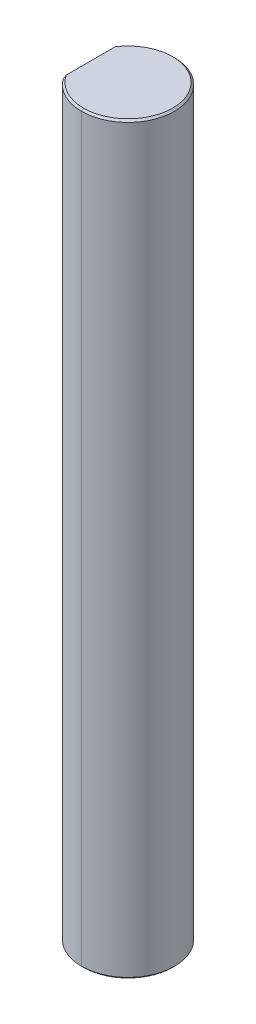
ISO-10303-21;
HEADER;
FILE_DESCRIPTION(('STEP AP214'),'2;1');
FILE_NAME('part.step','',(''),(''),'','','');
FILE_SCHEMA(('AUTOMOTIVE_DESIGN { 1 0 10303 214 1 1 1 1 }'));
ENDSEC;
DATA;
#1=APPLICATION_CONTEXT('core data for automotive mechanical design processes');
#2=APPLICATION_PROTOCOL_DEFINITION('international standard','automotive_design',2000,#1);
#3=PRODUCT_CONTEXT('',#1,'mechanical');
#4=PRODUCT('Part','Part','',(#3));
#5=PRODUCT_RELATED_PRODUCT_CATEGORY('part','',(#4));
#6=PRODUCT_DEFINITION_FORMATION('','',#4);
#7=PRODUCT_DEFINITION_CONTEXT('part definition',#1,'design');
#8=PRODUCT_DEFINITION('design','',#6,#7);
#9=PRODUCT_DEFINITION_SHAPE('','',#8);
#10=(LENGTH_UNIT() NAMED_UNIT(*) SI_UNIT(.MILLI.,.METRE.));
#11=(NAMED_UNIT(*) PLANE_ANGLE_UNIT() SI_UNIT($,.RADIAN.));
#12=(NAMED_UNIT(*) SI_UNIT($,.STERADIAN.) SOLID_ANGLE_UNIT());
#13=UNCERTAINTY_MEASURE_WITH_UNIT(LENGTH_MEASURE(1.E-05),#10,'distance_accuracy_value','');
#14=(GEOMETRIC_REPRESENTATION_CONTEXT(3) GLOBAL_UNCERTAINTY_ASSIGNED_CONTEXT((#13)) GLOBAL_UNIT_ASSIGNED_CONTEXT((#10,
#11,#12)) REPRESENTATION_CONTEXT('',''));
#15=CARTESIAN_POINT('',(0.,0.,0.));
#16=DIRECTION('',(0.,0.,1.));
#17=DIRECTION('',(1.,0.,0.));
#18=AXIS2_PLACEMENT_3D('',#15,#16,#17);
#19=CARTESIAN_POINT('',(0.,50.8,0.));
#20=DIRECTION('',(0.,-1.,0.));
#21=DIRECTION('',(0.,0.,-1.));
#22=AXIS2_PLACEMENT_3D('',#19,#20,#21);
#23=CONICAL_SURFACE('',#22,3.04419,0.785398163397457);
#24=DIRECTION('',(0.,-0.707106781186542,0.707106781186554));
#25=VECTOR('',#24,1.);
#26=CARTESIAN_POINT('',(0.,50.8,3.04419));
#27=LINE('',#26,#25);
#28=CARTESIAN_POINT('',(0.,50.8,3.04419));
#29=VERTEX_POINT('',#28);
#30=CARTESIAN_POINT('',(0.,50.673,3.17119));
#31=VERTEX_POINT('',#30);
#32=EDGE_CURVE('E188',#29,#31,#27,.T.);
#33=ORIENTED_EDGE('',*,*,#32,.F.);
#34=CARTESIAN_POINT('',(0.,50.8,0.));
#35=DIRECTION('',(0.,1.,0.));
#36=DIRECTION('',(0.,0.,1.));
#37=AXIS2_PLACEMENT_3D('',#34,#35,#36);
#38=CIRCLE('',#37,3.04419);
#39=CARTESIAN_POINT('',(-2.54381,50.8,1.67216130800829));
#40=VERTEX_POINT('',#39);
#41=EDGE_CURVE('E27',#40,#29,#38,.T.);
#42=ORIENTED_EDGE('',*,*,#41,.F.);
#43=CARTESIAN_POINT('',(-2.54381,50.673,1.89353550270387));
#44=CARTESIAN_POINT('',(-2.54381,50.7166137464441,1.8204935785422));
#45=CARTESIAN_POINT('',(-2.54381,50.7590424142679,1.74672509100731));
#46=CARTESIAN_POINT('',(-2.54381,50.8,1.67216130800829));
#47=(BOUNDED_CURVE() B_SPLINE_CURVE(3,(#43,#44,#45,#46),.UNSPECIFIED.,.F.,
.F.) B_SPLINE_CURVE_WITH_KNOTS((4,4),(0.,0.000255216641458037),
.UNSPECIFIED.) CURVE() GEOMETRIC_REPRESENTATION_ITEM() RATIONAL_B_SPLINE_CURVE((1.,1.,1.,1.)) REPRESENTATION_ITEM(''));
#48=CARTESIAN_POINT('',(-2.54381,50.673,1.89353550270387));
#49=VERTEX_POINT('',#48);
#50=EDGE_CURVE('E110',#49,#40,#47,.T.);
#51=ORIENTED_EDGE('',*,*,#50,.F.);
#52=CARTESIAN_POINT('',(0.,50.673,0.));
#53=DIRECTION('',(0.,-1.,0.));
#54=DIRECTION('',(0.,0.,1.));
#55=AXIS2_PLACEMENT_3D('',#52,#53,#54);
#56=CIRCLE('',#55,3.17119);
#57=EDGE_CURVE('E113',#31,#49,#56,.T.);
#58=ORIENTED_EDGE('',*,*,#57,.F.);
#59=EDGE_LOOP('',(#33,#42,#51,#58));
#60=FACE_BOUND('',#59,.T.);
#61=ADVANCED_FACE('F16',(#60),#23,.T.);
#62=CARTESIAN_POINT('',(0.,0.127000000000002,0.));
#63=DIRECTION('',(0.,1.,0.));
#64=DIRECTION('',(0.,0.,1.));
#65=AXIS2_PLACEMENT_3D('',#62,#63,#64);
#66=CONICAL_SURFACE('',#65,3.17119,0.785398163397457);
#67=DIRECTION('',(0.,0.707106781186542,-0.707106781186554));
#68=VECTOR('',#67,1.);
#69=CARTESIAN_POINT('',(0.,0.127000000000002,-3.17119));
#70=LINE('',#69,#68);
#71=CARTESIAN_POINT('',(0.,0.,-3.04419));
#72=VERTEX_POINT('',#71);
#73=CARTESIAN_POINT('',(0.,0.127000000000002,-3.17119));
#74=VERTEX_POINT('',#73);
#75=EDGE_CURVE('E152',#72,#74,#70,.T.);
#76=ORIENTED_EDGE('',*,*,#75,.F.);
#77=CARTESIAN_POINT('',(0.,0.,0.));
#78=DIRECTION('',(0.,-1.,0.));
#79=DIRECTION('',(0.,0.,1.));
#80=AXIS2_PLACEMENT_3D('',#77,#78,#79);
#81=CIRCLE('',#80,3.04419);
#82=CARTESIAN_POINT('',(-2.54381,0.,-1.67216130800829));
#83=VERTEX_POINT('',#82);
#84=EDGE_CURVE('E11',#83,#72,#81,.T.);
#85=ORIENTED_EDGE('',*,*,#84,.F.);
#86=CARTESIAN_POINT('',(-2.54381,0.127000000000002,-1.89353550270387));
#87=CARTESIAN_POINT('',(-2.54381,0.08338625355595,-1.8204935785422));
#88=CARTESIAN_POINT('',(-2.54381,0.0409575857320566,-1.74672509100731));
#89=CARTESIAN_POINT('',(-2.54381,0.,-1.67216130800829));
#90=(BOUNDED_CURVE() B_SPLINE_CURVE(3,(#86,#87,#88,#89),.UNSPECIFIED.,.F.,
.F.) B_SPLINE_CURVE_WITH_KNOTS((4,4),(0.,0.000255216641458037),
.UNSPECIFIED.) CURVE() GEOMETRIC_REPRESENTATION_ITEM() RATIONAL_B_SPLINE_CURVE((1.,1.,1.,1.)) REPRESENTATION_ITEM(''));
#91=CARTESIAN_POINT('',(-2.54381,0.127000000000002,-1.89353550270387));
#92=VERTEX_POINT('',#91);
#93=EDGE_CURVE('E128',#92,#83,#90,.T.);
#94=ORIENTED_EDGE('',*,*,#93,.F.);
#95=CARTESIAN_POINT('',(0.,0.127000000000002,0.));
#96=DIRECTION('',(0.,1.,0.));
#97=DIRECTION('',(0.,0.,1.));
#98=AXIS2_PLACEMENT_3D('',#95,#96,#97);
#99=CIRCLE('',#98,3.17119);
#100=EDGE_CURVE('E139',#74,#92,#99,.T.);
#101=ORIENTED_EDGE('',*,*,#100,.F.);
#102=EDGE_LOOP('',(#76,#85,#94,#101));
#103=FACE_BOUND('',#102,.T.);
#104=ADVANCED_FACE('F236',(#103),#66,.T.);
#105=CARTESIAN_POINT('',(0.,0.,0.));
#106=DIRECTION('',(0.,1.,0.));
#107=DIRECTION('',(1.,0.,0.));
#108=AXIS2_PLACEMENT_3D('',#105,#106,#107);
#109=PLANE('',#108);
#110=DIRECTION('',(0.,0.,1.));
#111=VECTOR('',#110,1.);
#112=CARTESIAN_POINT('',(-2.54381,0.,-1.89353550270387));
#113=LINE('',#112,#111);
#114=CARTESIAN_POINT('',(-2.54381,0.,1.67216130800829));
#115=VERTEX_POINT('',#114);
#116=EDGE_CURVE('E116',#83,#115,#113,.T.);
#117=ORIENTED_EDGE('',*,*,#116,.F.);
#118=ORIENTED_EDGE('',*,*,#84,.T.);
#119=CARTESIAN_POINT('',(0.,0.,0.));
#120=DIRECTION('',(0.,-1.,0.));
#121=DIRECTION('',(0.,0.,1.));
#122=AXIS2_PLACEMENT_3D('',#119,#120,#121);
#123=CIRCLE('',#122,3.04419);
#124=CARTESIAN_POINT('',(0.,0.,3.04419));
#125=VERTEX_POINT('',#124);
#126=EDGE_CURVE('E148',#72,#125,#123,.T.);
#127=ORIENTED_EDGE('',*,*,#126,.T.);
#128=CARTESIAN_POINT('',(0.,0.,0.));
#129=DIRECTION('',(0.,-1.,0.));
#130=DIRECTION('',(0.,0.,1.));
#131=AXIS2_PLACEMENT_3D('',#128,#129,#130);
#132=CIRCLE('',#131,3.04419);
#133=EDGE_CURVE('E157',#125,#115,#132,.T.);
#134=ORIENTED_EDGE('',*,*,#133,.T.);
#135=EDGE_LOOP('',(#117,#118,#127,#134));
#136=FACE_BOUND('',#135,.T.);
#137=ADVANCED_FACE('F18',(#136),#109,.F.);
#138=CARTESIAN_POINT('',(0.,50.8,0.));
#139=DIRECTION('',(0.,1.,0.));
#140=DIRECTION('',(1.,0.,0.));
#141=AXIS2_PLACEMENT_3D('',#138,#139,#140);
#142=PLANE('',#141);
#143=DIRECTION('',(0.,0.,1.));
#144=VECTOR('',#143,1.);
#145=CARTESIAN_POINT('',(-2.54381,50.8,-1.89353550270387));
#146=LINE('',#145,#144);
#147=CARTESIAN_POINT('',(-2.54381,50.8,-1.67216130800829));
#148=VERTEX_POINT('',#147);
#149=EDGE_CURVE('E91',#148,#40,#146,.T.);
#150=ORIENTED_EDGE('',*,*,#149,.T.);
#151=ORIENTED_EDGE('',*,*,#41,.T.);
#152=CARTESIAN_POINT('',(0.,50.8,0.));
#153=DIRECTION('',(0.,1.,0.));
#154=DIRECTION('',(0.,0.,1.));
#155=AXIS2_PLACEMENT_3D('',#152,#153,#154);
#156=CIRCLE('',#155,3.04419);
#157=CARTESIAN_POINT('',(0.,50.8,-3.04419));
#158=VERTEX_POINT('',#157);
#159=EDGE_CURVE('E184',#29,#158,#156,.T.);
#160=ORIENTED_EDGE('',*,*,#159,.T.);
#161=CARTESIAN_POINT('',(0.,50.8,0.));
#162=DIRECTION('',(0.,1.,0.));
#163=DIRECTION('',(0.,0.,1.));
#164=AXIS2_PLACEMENT_3D('',#161,#162,#163);
#165=CIRCLE('',#164,3.04419);
#166=EDGE_CURVE('E20',#158,#148,#165,.T.);
#167=ORIENTED_EDGE('',*,*,#166,.T.);
#168=EDGE_LOOP('',(#150,#151,#160,#167));
#169=FACE_BOUND('',#168,.T.);
#170=ADVANCED_FACE('F333',(#169),#142,.T.);
#171=CARTESIAN_POINT('',(-2.54381,50.8,-1.89353550270387));
#172=DIRECTION('',(1.,0.,0.));
#173=DIRECTION('',(0.,1.,0.));
#174=AXIS2_PLACEMENT_3D('',#171,#172,#173);
#175=PLANE('',#174);
#176=DIRECTION('',(0.,-1.,0.));
#177=VECTOR('',#176,1.);
#178=CARTESIAN_POINT('',(-2.54381,50.8,-1.89353550270387));
#179=LINE('',#178,#177);
#180=CARTESIAN_POINT('',(-2.54381,50.673,-1.89353550270387));
#181=VERTEX_POINT('',#180);
#182=EDGE_CURVE('E133',#181,#92,#179,.T.);
#183=ORIENTED_EDGE('',*,*,#182,.T.);
#184=ORIENTED_EDGE('',*,*,#93,.T.);
#185=ORIENTED_EDGE('',*,*,#116,.T.);
#186=CARTESIAN_POINT('',(-2.54381,0.,1.67216130800829));
#187=CARTESIAN_POINT('',(-2.54381,0.0409575857320628,1.7467250910073));
#188=CARTESIAN_POINT('',(-2.54381,0.0833862535559464,1.82049357854221));
#189=CARTESIAN_POINT('',(-2.54381,0.127000000000002,1.89353550270387));
#190=(BOUNDED_CURVE() B_SPLINE_CURVE(3,(#186,#187,#188,#189),.UNSPECIFIED.,.F.,
.F.) B_SPLINE_CURVE_WITH_KNOTS((4,4),(0.,0.000255216641458037),
.UNSPECIFIED.) CURVE() GEOMETRIC_REPRESENTATION_ITEM() RATIONAL_B_SPLINE_CURVE((1.,1.,1.,1.)) REPRESENTATION_ITEM(''));
#191=CARTESIAN_POINT('',(-2.54381,0.127000000000002,1.89353550270387));
#192=VERTEX_POINT('',#191);
#193=EDGE_CURVE('E123',#115,#192,#190,.T.);
#194=ORIENTED_EDGE('',*,*,#193,.T.);
#195=DIRECTION('',(0.,-1.,0.));
#196=VECTOR('',#195,1.);
#197=CARTESIAN_POINT('',(-2.54381,50.8,1.89353550270387));
#198=LINE('',#197,#196);
#199=EDGE_CURVE('E119',#49,#192,#198,.T.);
#200=ORIENTED_EDGE('',*,*,#199,.F.);
#201=ORIENTED_EDGE('',*,*,#50,.T.);
#202=ORIENTED_EDGE('',*,*,#149,.F.);
#203=CARTESIAN_POINT('',(-2.54381,50.8,-1.67216130800829));
#204=CARTESIAN_POINT('',(-2.54381,50.7590424142679,-1.7467250910073));
#205=CARTESIAN_POINT('',(-2.54381,50.7166137464441,-1.82049357854221));
#206=CARTESIAN_POINT('',(-2.54381,50.673,-1.89353550270387));
#207=(BOUNDED_CURVE() B_SPLINE_CURVE(3,(#203,#204,#205,#206),.UNSPECIFIED.,.F.,
.F.) B_SPLINE_CURVE_WITH_KNOTS((4,4),(0.,0.000255216641458036),
.UNSPECIFIED.) CURVE() GEOMETRIC_REPRESENTATION_ITEM() RATIONAL_B_SPLINE_CURVE((1.,1.,1.,1.)) REPRESENTATION_ITEM(''));
#208=EDGE_CURVE('E147',#148,#181,#207,.T.);
#209=ORIENTED_EDGE('',*,*,#208,.T.);
#210=EDGE_LOOP('',(#183,#184,#185,#194,#200,#201,#202,#209));
#211=FACE_BOUND('',#210,.T.);
#212=ADVANCED_FACE('F121',(#211),#175,.F.);
#213=CARTESIAN_POINT('',(0.,50.8,0.));
#214=DIRECTION('',(0.,-1.,0.));
#215=DIRECTION('',(0.,0.,-1.));
#216=AXIS2_PLACEMENT_3D('',#213,#214,#215);
#217=CYLINDRICAL_SURFACE('',#216,3.17119);
#218=DIRECTION('',(0.,-1.,0.));
#219=VECTOR('',#218,1.);
#220=CARTESIAN_POINT('',(0.,50.8,3.17119));
#221=LINE('',#220,#219);
#222=CARTESIAN_POINT('',(0.,0.127000000000002,3.17119));
#223=VERTEX_POINT('',#222);
#224=EDGE_CURVE('E131',#31,#223,#221,.T.);
#225=ORIENTED_EDGE('',*,*,#224,.F.);
#226=ORIENTED_EDGE('',*,*,#57,.T.);
#227=ORIENTED_EDGE('',*,*,#199,.T.);
#228=CARTESIAN_POINT('',(0.,0.127000000000002,0.));
#229=DIRECTION('',(0.,1.,0.));
#230=DIRECTION('',(0.,0.,1.));
#231=AXIS2_PLACEMENT_3D('',#228,#229,#230);
#232=CIRCLE('',#231,3.17119);
#233=EDGE_CURVE('E165',#192,#223,#232,.T.);
#234=ORIENTED_EDGE('',*,*,#233,.T.);
#235=EDGE_LOOP('',(#225,#226,#227,#234));
#236=FACE_BOUND('',#235,.T.);
#237=ADVANCED_FACE('F130',(#236),#217,.T.);
#238=CARTESIAN_POINT('',(0.,50.8,0.));
#239=DIRECTION('',(0.,-1.,0.));
#240=DIRECTION('',(0.,0.,-1.));
#241=AXIS2_PLACEMENT_3D('',#238,#239,#240);
#242=CYLINDRICAL_SURFACE('',#241,3.17119);
#243=CARTESIAN_POINT('',(0.,50.673,0.));
#244=DIRECTION('',(0.,-1.,0.));
#245=DIRECTION('',(0.,0.,1.));
#246=AXIS2_PLACEMENT_3D('',#243,#244,#245);
#247=CIRCLE('',#246,3.17119);
#248=CARTESIAN_POINT('',(0.,50.673,-3.17119));
#249=VERTEX_POINT('',#248);
#250=EDGE_CURVE('E144',#181,#249,#247,.T.);
#251=ORIENTED_EDGE('',*,*,#250,.T.);
#252=DIRECTION('',(0.,-1.,0.));
#253=VECTOR('',#252,1.);
#254=CARTESIAN_POINT('',(0.,50.8,-3.17119));
#255=LINE('',#254,#253);
#256=EDGE_CURVE('E105',#249,#74,#255,.T.);
#257=ORIENTED_EDGE('',*,*,#256,.T.);
#258=ORIENTED_EDGE('',*,*,#100,.T.);
#259=ORIENTED_EDGE('',*,*,#182,.F.);
#260=EDGE_LOOP('',(#251,#257,#258,#259));
#261=FACE_BOUND('',#260,.T.);
#262=ADVANCED_FACE('F239',(#261),#242,.T.);
#263=CARTESIAN_POINT('',(0.,50.8,0.));
#264=DIRECTION('',(0.,-1.,0.));
#265=DIRECTION('',(0.,0.,-1.));
#266=AXIS2_PLACEMENT_3D('',#263,#264,#265);
#267=CYLINDRICAL_SURFACE('',#266,3.17119);
#268=CARTESIAN_POINT('',(0.,50.673,0.));
#269=DIRECTION('',(0.,-1.,0.));
#270=DIRECTION('',(0.,0.,1.));
#271=AXIS2_PLACEMENT_3D('',#268,#269,#270);
#272=CIRCLE('',#271,3.17119);
#273=EDGE_CURVE('E192',#249,#31,#272,.T.);
#274=ORIENTED_EDGE('',*,*,#273,.T.);
#275=ORIENTED_EDGE('',*,*,#224,.T.);
#276=CARTESIAN_POINT('',(0.,0.127000000000002,0.));
#277=DIRECTION('',(0.,1.,0.));
#278=DIRECTION('',(0.,0.,1.));
#279=AXIS2_PLACEMENT_3D('',#276,#277,#278);
#280=CIRCLE('',#279,3.17119);
#281=EDGE_CURVE('E158',#223,#74,#280,.T.);
#282=ORIENTED_EDGE('',*,*,#281,.T.);
#283=ORIENTED_EDGE('',*,*,#256,.F.);
#284=EDGE_LOOP('',(#274,#275,#282,#283));
#285=FACE_BOUND('',#284,.T.);
#286=ADVANCED_FACE('F229',(#285),#267,.T.);
#287=CARTESIAN_POINT('',(0.,0.127000000000002,0.));
#288=DIRECTION('',(0.,1.,0.));
#289=DIRECTION('',(0.,0.,1.));
#290=AXIS2_PLACEMENT_3D('',#287,#288,#289);
#291=CONICAL_SURFACE('',#290,3.17119,0.785398163397457);
#292=ORIENTED_EDGE('',*,*,#133,.F.);
#293=DIRECTION('',(0.,0.707106781186542,0.707106781186554));
#294=VECTOR('',#293,1.);
#295=CARTESIAN_POINT('',(0.,0.127000000000002,3.17119));
#296=LINE('',#295,#294);
#297=EDGE_CURVE('E153',#125,#223,#296,.T.);
#298=ORIENTED_EDGE('',*,*,#297,.T.);
#299=ORIENTED_EDGE('',*,*,#233,.F.);
#300=ORIENTED_EDGE('',*,*,#193,.F.);
#301=EDGE_LOOP('',(#292,#298,#299,#300));
#302=FACE_BOUND('',#301,.T.);
#303=ADVANCED_FACE('F344',(#302),#291,.T.);
#304=CARTESIAN_POINT('',(0.,0.127000000000002,0.));
#305=DIRECTION('',(0.,1.,0.));
#306=DIRECTION('',(0.,0.,1.));
#307=AXIS2_PLACEMENT_3D('',#304,#305,#306);
#308=CONICAL_SURFACE('',#307,3.17119,0.785398163397457);
#309=ORIENTED_EDGE('',*,*,#126,.F.);
#310=ORIENTED_EDGE('',*,*,#75,.T.);
#311=ORIENTED_EDGE('',*,*,#281,.F.);
#312=ORIENTED_EDGE('',*,*,#297,.F.);
#313=EDGE_LOOP('',(#309,#310,#311,#312));
#314=FACE_BOUND('',#313,.T.);
#315=ADVANCED_FACE('F234',(#314),#308,.T.);
#316=CARTESIAN_POINT('',(0.,50.8,0.));
#317=DIRECTION('',(0.,-1.,0.));
#318=DIRECTION('',(0.,0.,-1.));
#319=AXIS2_PLACEMENT_3D('',#316,#317,#318);
#320=CONICAL_SURFACE('',#319,3.04419,0.785398163397457);
#321=ORIENTED_EDGE('',*,*,#166,.F.);
#322=DIRECTION('',(0.,-0.707106781186542,-0.707106781186554));
#323=VECTOR('',#322,1.);
#324=CARTESIAN_POINT('',(0.,50.8,-3.04419));
#325=LINE('',#324,#323);
#326=EDGE_CURVE('E197',#158,#249,#325,.T.);
#327=ORIENTED_EDGE('',*,*,#326,.T.);
#328=ORIENTED_EDGE('',*,*,#250,.F.);
#329=ORIENTED_EDGE('',*,*,#208,.F.);
#330=EDGE_LOOP('',(#321,#327,#328,#329));
#331=FACE_BOUND('',#330,.T.);
#332=ADVANCED_FACE('F244',(#331),#320,.T.);
#333=CARTESIAN_POINT('',(0.,50.8,0.));
#334=DIRECTION('',(0.,-1.,0.));
#335=DIRECTION('',(0.,0.,-1.));
#336=AXIS2_PLACEMENT_3D('',#333,#334,#335);
#337=CONICAL_SURFACE('',#336,3.04419,0.785398163397457);
#338=ORIENTED_EDGE('',*,*,#159,.F.);
#339=ORIENTED_EDGE('',*,*,#32,.T.);
#340=ORIENTED_EDGE('',*,*,#273,.F.);
#341=ORIENTED_EDGE('',*,*,#326,.F.);
#342=EDGE_LOOP('',(#338,#339,#340,#341));
#343=FACE_BOUND('',#342,.T.);
#344=ADVANCED_FACE('F248',(#343),#337,.T.);
#345=CLOSED_SHELL('',(#61,#104,#137,#170,#212,#237,#262,#286,#303,#315,#332,#344));
#346=MANIFOLD_SOLID_BREP('B1',#345);
#347=ADVANCED_BREP_SHAPE_REPRESENTATION('',(#18,#346),#14);
#348=SHAPE_DEFINITION_REPRESENTATION(#9,#347);
ENDSEC;
END-ISO-10303-21;
